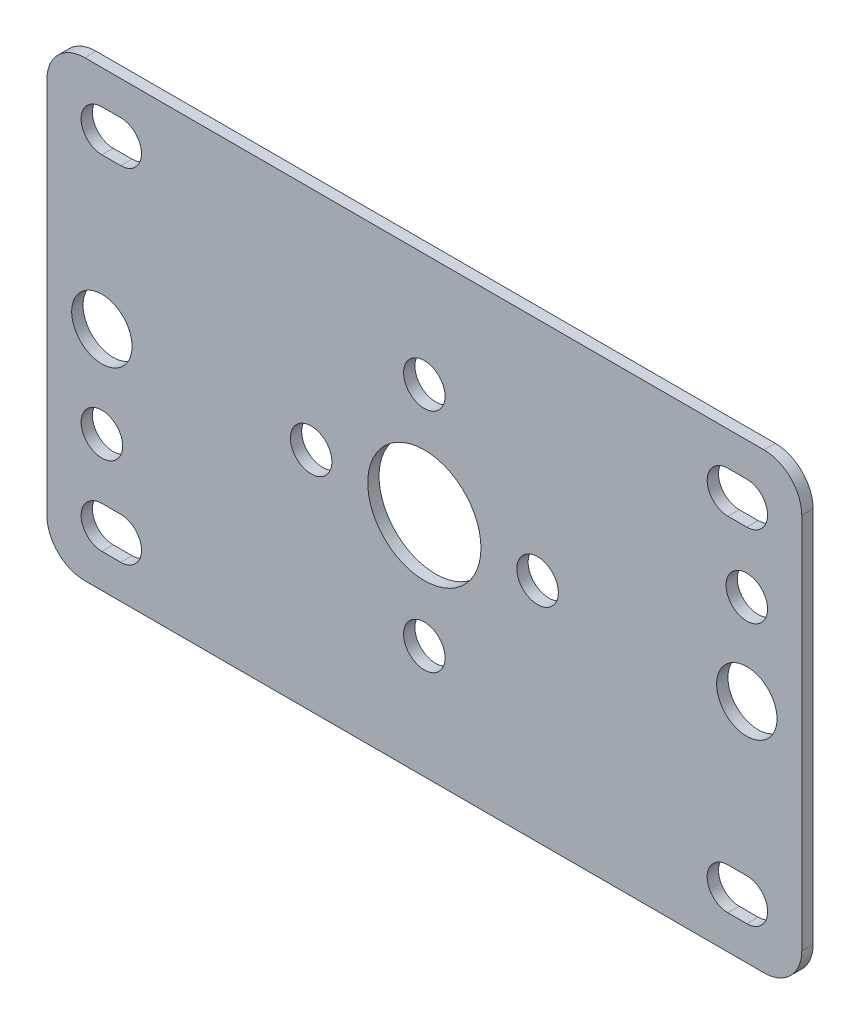
ISO-10303-21;
HEADER;
FILE_DESCRIPTION(('STEP AP214'),'2;1');
FILE_NAME('part.step','',(''),(''),'','','');
FILE_SCHEMA(('AUTOMOTIVE_DESIGN { 1 0 10303 214 1 1 1 1 }'));
ENDSEC;
DATA;
#1=APPLICATION_CONTEXT('core data for automotive mechanical design processes');
#2=APPLICATION_PROTOCOL_DEFINITION('international standard','automotive_design',2000,#1);
#3=PRODUCT_CONTEXT('',#1,'mechanical');
#4=PRODUCT('Part','Part','',(#3));
#5=PRODUCT_RELATED_PRODUCT_CATEGORY('part','',(#4));
#6=PRODUCT_DEFINITION_FORMATION('','',#4);
#7=PRODUCT_DEFINITION_CONTEXT('part definition',#1,'design');
#8=PRODUCT_DEFINITION('design','',#6,#7);
#9=PRODUCT_DEFINITION_SHAPE('','',#8);
#10=(LENGTH_UNIT() NAMED_UNIT(*) SI_UNIT(.MILLI.,.METRE.));
#11=(NAMED_UNIT(*) PLANE_ANGLE_UNIT() SI_UNIT($,.RADIAN.));
#12=(NAMED_UNIT(*) SI_UNIT($,.STERADIAN.) SOLID_ANGLE_UNIT());
#13=UNCERTAINTY_MEASURE_WITH_UNIT(LENGTH_MEASURE(1.E-05),#10,'distance_accuracy_value','');
#14=(GEOMETRIC_REPRESENTATION_CONTEXT(3) GLOBAL_UNCERTAINTY_ASSIGNED_CONTEXT((#13)) GLOBAL_UNIT_ASSIGNED_CONTEXT((#10,
#11,#12)) REPRESENTATION_CONTEXT('',''));
#15=CARTESIAN_POINT('',(0.,0.,0.));
#16=DIRECTION('',(0.,0.,1.));
#17=DIRECTION('',(1.,0.,0.));
#18=AXIS2_PLACEMENT_3D('',#15,#16,#17);
#19=CARTESIAN_POINT('',(0.,0.,-1.5));
#20=DIRECTION('',(0.,0.,1.));
#21=DIRECTION('',(1.,0.,0.));
#22=AXIS2_PLACEMENT_3D('',#19,#20,#21);
#23=PLANE('',#22);
#24=DIRECTION('',(1.,0.,0.));
#25=VECTOR('',#24,1.);
#26=CARTESIAN_POINT('',(40.22,-20.,-1.5));
#27=LINE('',#26,#25);
#28=CARTESIAN_POINT('',(40.22,-20.,-1.5));
#29=VERTEX_POINT('',#28);
#30=CARTESIAN_POINT('',(42.72,-20.,-1.5));
#31=VERTEX_POINT('',#30);
#32=EDGE_CURVE('E291',#29,#31,#27,.T.);
#33=ORIENTED_EDGE('',*,*,#32,.F.);
#34=CARTESIAN_POINT('',(40.22,-22.75,-1.5));
#35=DIRECTION('',(0.,0.,1.));
#36=DIRECTION('',(1.,0.,0.));
#37=AXIS2_PLACEMENT_3D('',#34,#35,#36);
#38=CIRCLE('',#37,2.75);
#39=CARTESIAN_POINT('',(40.22,-25.5,-1.5));
#40=VERTEX_POINT('',#39);
#41=EDGE_CURVE('E292',#29,#40,#38,.T.);
#42=ORIENTED_EDGE('',*,*,#41,.T.);
#43=DIRECTION('',(1.,0.,0.));
#44=VECTOR('',#43,1.);
#45=CARTESIAN_POINT('',(42.72,-25.5,-1.5));
#46=LINE('',#45,#44);
#47=CARTESIAN_POINT('',(42.72,-25.5,-1.5));
#48=VERTEX_POINT('',#47);
#49=EDGE_CURVE('E356',#48,#40,#46,.F.);
#50=ORIENTED_EDGE('',*,*,#49,.F.);
#51=CARTESIAN_POINT('',(42.72,-22.75,-1.5));
#52=DIRECTION('',(0.,0.,1.));
#53=DIRECTION('',(1.,0.,0.));
#54=AXIS2_PLACEMENT_3D('',#51,#52,#53);
#55=CIRCLE('',#54,2.75);
#56=EDGE_CURVE('E288',#48,#31,#55,.T.);
#57=ORIENTED_EDGE('',*,*,#56,.T.);
#58=EDGE_LOOP('',(#33,#42,#50,#57));
#59=FACE_BOUND('',#58,.T.);
#60=CARTESIAN_POINT('',(-40.22,-22.75,-1.5));
#61=DIRECTION('',(0.,0.,1.));
#62=DIRECTION('',(1.,0.,0.));
#63=AXIS2_PLACEMENT_3D('',#60,#61,#62);
#64=CIRCLE('',#63,2.75);
#65=CARTESIAN_POINT('',(-40.22,-25.5,-1.5));
#66=VERTEX_POINT('',#65);
#67=CARTESIAN_POINT('',(-40.22,-20.,-1.5));
#68=VERTEX_POINT('',#67);
#69=EDGE_CURVE('E299',#66,#68,#64,.T.);
#70=ORIENTED_EDGE('',*,*,#69,.T.);
#71=DIRECTION('',(1.,0.,0.));
#72=VECTOR('',#71,1.);
#73=CARTESIAN_POINT('',(-42.72,-20.,-1.5));
#74=LINE('',#73,#72);
#75=CARTESIAN_POINT('',(-42.72,-20.,-1.5));
#76=VERTEX_POINT('',#75);
#77=EDGE_CURVE('E302',#76,#68,#74,.T.);
#78=ORIENTED_EDGE('',*,*,#77,.F.);
#79=CARTESIAN_POINT('',(-42.72,-22.75,-1.5));
#80=DIRECTION('',(0.,0.,1.));
#81=DIRECTION('',(1.,0.,0.));
#82=AXIS2_PLACEMENT_3D('',#79,#80,#81);
#83=CIRCLE('',#82,2.75);
#84=CARTESIAN_POINT('',(-42.72,-25.5,-1.5));
#85=VERTEX_POINT('',#84);
#86=EDGE_CURVE('E296',#76,#85,#83,.T.);
#87=ORIENTED_EDGE('',*,*,#86,.T.);
#88=DIRECTION('',(1.,0.,0.));
#89=VECTOR('',#88,1.);
#90=CARTESIAN_POINT('',(-40.22,-25.5,-1.5));
#91=LINE('',#90,#89);
#92=EDGE_CURVE('E361',#66,#85,#91,.F.);
#93=ORIENTED_EDGE('',*,*,#92,.F.);
#94=EDGE_LOOP('',(#70,#78,#87,#93));
#95=FACE_BOUND('',#94,.T.);
#96=DIRECTION('',(1.,0.,0.));
#97=VECTOR('',#96,1.);
#98=CARTESIAN_POINT('',(-40.22,20.,-1.5));
#99=LINE('',#98,#97);
#100=CARTESIAN_POINT('',(-40.22,20.,-1.5));
#101=VERTEX_POINT('',#100);
#102=CARTESIAN_POINT('',(-42.72,20.,-1.5));
#103=VERTEX_POINT('',#102);
#104=EDGE_CURVE('E306',#101,#103,#99,.F.);
#105=ORIENTED_EDGE('',*,*,#104,.F.);
#106=CARTESIAN_POINT('',(-40.22,22.75,-1.5));
#107=DIRECTION('',(0.,0.,1.));
#108=DIRECTION('',(1.,0.,0.));
#109=AXIS2_PLACEMENT_3D('',#106,#107,#108);
#110=CIRCLE('',#109,2.75);
#111=CARTESIAN_POINT('',(-40.22,25.5,-1.5));
#112=VERTEX_POINT('',#111);
#113=EDGE_CURVE('E307',#101,#112,#110,.T.);
#114=ORIENTED_EDGE('',*,*,#113,.T.);
#115=DIRECTION('',(1.,0.,0.));
#116=VECTOR('',#115,1.);
#117=CARTESIAN_POINT('',(-42.72,25.5,-1.5));
#118=LINE('',#117,#116);
#119=CARTESIAN_POINT('',(-42.72,25.5,-1.5));
#120=VERTEX_POINT('',#119);
#121=EDGE_CURVE('E368',#120,#112,#118,.T.);
#122=ORIENTED_EDGE('',*,*,#121,.F.);
#123=CARTESIAN_POINT('',(-42.72,22.75,-1.5));
#124=DIRECTION('',(0.,0.,1.));
#125=DIRECTION('',(1.,0.,0.));
#126=AXIS2_PLACEMENT_3D('',#123,#124,#125);
#127=CIRCLE('',#126,2.75);
#128=EDGE_CURVE('E303',#120,#103,#127,.T.);
#129=ORIENTED_EDGE('',*,*,#128,.T.);
#130=EDGE_LOOP('',(#105,#114,#122,#129));
#131=FACE_BOUND('',#130,.T.);
#132=CARTESIAN_POINT('',(40.22,22.75,-1.5));
#133=DIRECTION('',(0.,0.,1.));
#134=DIRECTION('',(1.,0.,0.));
#135=AXIS2_PLACEMENT_3D('',#132,#133,#134);
#136=CIRCLE('',#135,2.75);
#137=CARTESIAN_POINT('',(40.22,25.5,-1.5));
#138=VERTEX_POINT('',#137);
#139=CARTESIAN_POINT('',(40.22,20.,-1.5));
#140=VERTEX_POINT('',#139);
#141=EDGE_CURVE('E314',#138,#140,#136,.T.);
#142=ORIENTED_EDGE('',*,*,#141,.T.);
#143=DIRECTION('',(1.,0.,0.));
#144=VECTOR('',#143,1.);
#145=CARTESIAN_POINT('',(42.72,20.,-1.5));
#146=LINE('',#145,#144);
#147=CARTESIAN_POINT('',(42.72,20.,-1.5));
#148=VERTEX_POINT('',#147);
#149=EDGE_CURVE('E204',#148,#140,#146,.F.);
#150=ORIENTED_EDGE('',*,*,#149,.F.);
#151=CARTESIAN_POINT('',(42.72,22.75,-1.5));
#152=DIRECTION('',(0.,0.,1.));
#153=DIRECTION('',(1.,0.,0.));
#154=AXIS2_PLACEMENT_3D('',#151,#152,#153);
#155=CIRCLE('',#154,2.75);
#156=CARTESIAN_POINT('',(42.72,25.5,-1.5));
#157=VERTEX_POINT('',#156);
#158=EDGE_CURVE('E311',#148,#157,#155,.T.);
#159=ORIENTED_EDGE('',*,*,#158,.T.);
#160=DIRECTION('',(1.,0.,0.));
#161=VECTOR('',#160,1.);
#162=CARTESIAN_POINT('',(40.22,25.5,-1.5));
#163=LINE('',#162,#161);
#164=EDGE_CURVE('E373',#138,#157,#163,.T.);
#165=ORIENTED_EDGE('',*,*,#164,.F.);
#166=EDGE_LOOP('',(#142,#150,#159,#165));
#167=FACE_BOUND('',#166,.T.);
#168=CARTESIAN_POINT('',(42.72,0.,-1.5));
#169=DIRECTION('',(0.,0.,1.));
#170=DIRECTION('',(1.,0.,0.));
#171=AXIS2_PLACEMENT_3D('',#168,#169,#170);
#172=CIRCLE('',#171,4.);
#173=CARTESIAN_POINT('',(46.72,0.,-1.5));
#174=VERTEX_POINT('',#173);
#175=EDGE_CURVE('E317',#174,#174,#172,.T.);
#176=ORIENTED_EDGE('',*,*,#175,.T.);
#177=EDGE_LOOP('',(#176));
#178=FACE_BOUND('',#177,.T.);
#179=CARTESIAN_POINT('',(0.,0.,-1.5));
#180=DIRECTION('',(0.,0.,1.));
#181=DIRECTION('',(1.,0.,0.));
#182=AXIS2_PLACEMENT_3D('',#179,#180,#181);
#183=CIRCLE('',#182,7.5);
#184=CARTESIAN_POINT('',(7.5,0.,-1.5));
#185=VERTEX_POINT('',#184);
#186=EDGE_CURVE('E320',#185,#185,#183,.T.);
#187=ORIENTED_EDGE('',*,*,#186,.T.);
#188=EDGE_LOOP('',(#187));
#189=FACE_BOUND('',#188,.T.);
#190=CARTESIAN_POINT('',(0.,-15.,-1.5));
#191=DIRECTION('',(0.,0.,1.));
#192=DIRECTION('',(1.,0.,0.));
#193=AXIS2_PLACEMENT_3D('',#190,#191,#192);
#194=CIRCLE('',#193,2.75);
#195=CARTESIAN_POINT('',(2.75,-15.,-1.5));
#196=VERTEX_POINT('',#195);
#197=EDGE_CURVE('E323',#196,#196,#194,.T.);
#198=ORIENTED_EDGE('',*,*,#197,.T.);
#199=EDGE_LOOP('',(#198));
#200=FACE_BOUND('',#199,.T.);
#201=CARTESIAN_POINT('',(-15.,0.,-1.5));
#202=DIRECTION('',(0.,0.,1.));
#203=DIRECTION('',(1.,0.,0.));
#204=AXIS2_PLACEMENT_3D('',#201,#202,#203);
#205=CIRCLE('',#204,2.75);
#206=CARTESIAN_POINT('',(-12.25,0.,-1.5));
#207=VERTEX_POINT('',#206);
#208=EDGE_CURVE('E326',#207,#207,#205,.T.);
#209=ORIENTED_EDGE('',*,*,#208,.T.);
#210=EDGE_LOOP('',(#209));
#211=FACE_BOUND('',#210,.T.);
#212=CARTESIAN_POINT('',(0.,15.,-1.5));
#213=DIRECTION('',(0.,0.,1.));
#214=DIRECTION('',(1.,0.,0.));
#215=AXIS2_PLACEMENT_3D('',#212,#213,#214);
#216=CIRCLE('',#215,2.75);
#217=CARTESIAN_POINT('',(2.75000000000001,15.,-1.5));
#218=VERTEX_POINT('',#217);
#219=EDGE_CURVE('E329',#218,#218,#216,.T.);
#220=ORIENTED_EDGE('',*,*,#219,.T.);
#221=EDGE_LOOP('',(#220));
#222=FACE_BOUND('',#221,.T.);
#223=CARTESIAN_POINT('',(15.,0.,-1.5));
#224=DIRECTION('',(0.,0.,1.));
#225=DIRECTION('',(1.,0.,0.));
#226=AXIS2_PLACEMENT_3D('',#223,#224,#225);
#227=CIRCLE('',#226,2.75);
#228=CARTESIAN_POINT('',(17.75,0.,-1.5));
#229=VERTEX_POINT('',#228);
#230=EDGE_CURVE('E332',#229,#229,#227,.T.);
#231=ORIENTED_EDGE('',*,*,#230,.T.);
#232=EDGE_LOOP('',(#231));
#233=FACE_BOUND('',#232,.T.);
#234=CARTESIAN_POINT('',(-42.72,-12.05,-1.5));
#235=DIRECTION('',(0.,0.,1.));
#236=DIRECTION('',(1.,0.,0.));
#237=AXIS2_PLACEMENT_3D('',#234,#235,#236);
#238=CIRCLE('',#237,2.75);
#239=CARTESIAN_POINT('',(-39.97,-12.05,-1.5));
#240=VERTEX_POINT('',#239);
#241=EDGE_CURVE('E335',#240,#240,#238,.T.);
#242=ORIENTED_EDGE('',*,*,#241,.T.);
#243=EDGE_LOOP('',(#242));
#244=FACE_BOUND('',#243,.T.);
#245=CARTESIAN_POINT('',(42.72,11.97,-1.5));
#246=DIRECTION('',(0.,0.,1.));
#247=DIRECTION('',(1.,0.,0.));
#248=AXIS2_PLACEMENT_3D('',#245,#246,#247);
#249=CIRCLE('',#248,2.75);
#250=CARTESIAN_POINT('',(45.47,11.97,-1.5));
#251=VERTEX_POINT('',#250);
#252=EDGE_CURVE('E338',#251,#251,#249,.T.);
#253=ORIENTED_EDGE('',*,*,#252,.T.);
#254=EDGE_LOOP('',(#253));
#255=FACE_BOUND('',#254,.T.);
#256=CARTESIAN_POINT('',(-42.72,0.,-1.5));
#257=DIRECTION('',(0.,0.,1.));
#258=DIRECTION('',(1.,0.,0.));
#259=AXIS2_PLACEMENT_3D('',#256,#257,#258);
#260=CIRCLE('',#259,4.);
#261=CARTESIAN_POINT('',(-38.72,0.,-1.5));
#262=VERTEX_POINT('',#261);
#263=EDGE_CURVE('E195',#262,#262,#260,.T.);
#264=ORIENTED_EDGE('',*,*,#263,.T.);
#265=EDGE_LOOP('',(#264));
#266=FACE_BOUND('',#265,.T.);
#267=DIRECTION('',(0.,1.,0.));
#268=VECTOR('',#267,1.);
#269=CARTESIAN_POINT('',(50.,-25.,-1.5));
#270=LINE('',#269,#268);
#271=CARTESIAN_POINT('',(50.,-25.,-1.5));
#272=VERTEX_POINT('',#271);
#273=CARTESIAN_POINT('',(50.,25.,-1.5));
#274=VERTEX_POINT('',#273);
#275=EDGE_CURVE('E206',#272,#274,#270,.T.);
#276=ORIENTED_EDGE('',*,*,#275,.F.);
#277=CARTESIAN_POINT('',(45.,-25.,-1.5));
#278=DIRECTION('',(0.,0.,1.));
#279=DIRECTION('',(1.,0.,0.));
#280=AXIS2_PLACEMENT_3D('',#277,#278,#279);
#281=CIRCLE('',#280,5.);
#282=CARTESIAN_POINT('',(45.,-30.,-1.5));
#283=VERTEX_POINT('',#282);
#284=EDGE_CURVE('E344',#283,#272,#281,.T.);
#285=ORIENTED_EDGE('',*,*,#284,.F.);
#286=DIRECTION('',(1.,0.,0.));
#287=VECTOR('',#286,1.);
#288=CARTESIAN_POINT('',(-45.,-30.,-1.5));
#289=LINE('',#288,#287);
#290=CARTESIAN_POINT('',(-45.,-30.,-1.5));
#291=VERTEX_POINT('',#290);
#292=EDGE_CURVE('E210',#291,#283,#289,.T.);
#293=ORIENTED_EDGE('',*,*,#292,.F.);
#294=CARTESIAN_POINT('',(-45.,-25.,-1.5));
#295=DIRECTION('',(0.,0.,1.));
#296=DIRECTION('',(1.,0.,0.));
#297=AXIS2_PLACEMENT_3D('',#294,#295,#296);
#298=CIRCLE('',#297,5.);
#299=CARTESIAN_POINT('',(-50.,-25.,-1.5));
#300=VERTEX_POINT('',#299);
#301=EDGE_CURVE('E345',#300,#291,#298,.T.);
#302=ORIENTED_EDGE('',*,*,#301,.F.);
#303=DIRECTION('',(0.,1.,0.));
#304=VECTOR('',#303,1.);
#305=CARTESIAN_POINT('',(-50.,25.,-1.5));
#306=LINE('',#305,#304);
#307=CARTESIAN_POINT('',(-50.,25.,-1.5));
#308=VERTEX_POINT('',#307);
#309=EDGE_CURVE('E183',#308,#300,#306,.F.);
#310=ORIENTED_EDGE('',*,*,#309,.F.);
#311=CARTESIAN_POINT('',(-45.,25.,-1.5));
#312=DIRECTION('',(0.,0.,1.));
#313=DIRECTION('',(1.,0.,0.));
#314=AXIS2_PLACEMENT_3D('',#311,#312,#313);
#315=CIRCLE('',#314,5.);
#316=CARTESIAN_POINT('',(-45.,30.,-1.5));
#317=VERTEX_POINT('',#316);
#318=EDGE_CURVE('E20',#317,#308,#315,.T.);
#319=ORIENTED_EDGE('',*,*,#318,.F.);
#320=DIRECTION('',(1.,0.,0.));
#321=VECTOR('',#320,1.);
#322=CARTESIAN_POINT('',(45.,30.,-1.5));
#323=LINE('',#322,#321);
#324=CARTESIAN_POINT('',(45.,30.,-1.5));
#325=VERTEX_POINT('',#324);
#326=EDGE_CURVE('E180',#325,#317,#323,.F.);
#327=ORIENTED_EDGE('',*,*,#326,.F.);
#328=CARTESIAN_POINT('',(45.,25.,-1.5));
#329=DIRECTION('',(0.,0.,1.));
#330=DIRECTION('',(1.,0.,0.));
#331=AXIS2_PLACEMENT_3D('',#328,#329,#330);
#332=CIRCLE('',#331,5.);
#333=EDGE_CURVE('E200',#274,#325,#332,.T.);
#334=ORIENTED_EDGE('',*,*,#333,.F.);
#335=EDGE_LOOP('',(#276,#285,#293,#302,#310,#319,#327,#334));
#336=FACE_BOUND('',#335,.T.);
#337=ADVANCED_FACE('F17',(#59,#95,#131,#167,#178,#189,#200,#211,#222,#233,#244,#255,#266,#336),
#23,.F.);
#338=CARTESIAN_POINT('',(-45.,25.,0.));
#339=DIRECTION('',(0.,0.,1.));
#340=DIRECTION('',(1.,0.,0.));
#341=AXIS2_PLACEMENT_3D('',#338,#339,#340);
#342=CYLINDRICAL_SURFACE('',#341,5.);
#343=DIRECTION('',(0.,0.,1.));
#344=VECTOR('',#343,1.);
#345=CARTESIAN_POINT('',(-50.,25.,0.));
#346=LINE('',#345,#344);
#347=CARTESIAN_POINT('',(-50.,25.,0.));
#348=VERTEX_POINT('',#347);
#349=EDGE_CURVE('E186',#348,#308,#346,.F.);
#350=ORIENTED_EDGE('',*,*,#349,.F.);
#351=CARTESIAN_POINT('',(-45.,25.,0.));
#352=DIRECTION('',(0.,0.,1.));
#353=DIRECTION('',(1.,0.,0.));
#354=AXIS2_PLACEMENT_3D('',#351,#352,#353);
#355=CIRCLE('',#354,5.);
#356=CARTESIAN_POINT('',(-45.,30.,0.));
#357=VERTEX_POINT('',#356);
#358=EDGE_CURVE('E191',#357,#348,#355,.T.);
#359=ORIENTED_EDGE('',*,*,#358,.F.);
#360=DIRECTION('',(0.,0.,1.));
#361=VECTOR('',#360,1.);
#362=CARTESIAN_POINT('',(-45.,30.,0.));
#363=LINE('',#362,#361);
#364=EDGE_CURVE('E188',#317,#357,#363,.T.);
#365=ORIENTED_EDGE('',*,*,#364,.F.);
#366=ORIENTED_EDGE('',*,*,#318,.T.);
#367=EDGE_LOOP('',(#350,#359,#365,#366));
#368=FACE_BOUND('',#367,.T.);
#369=ADVANCED_FACE('F189',(#368),#342,.T.);
#370=CARTESIAN_POINT('',(-50.,25.,0.));
#371=DIRECTION('',(-1.,0.,0.));
#372=DIRECTION('',(0.,0.,1.));
#373=AXIS2_PLACEMENT_3D('',#370,#371,#372);
#374=PLANE('',#373);
#375=DIRECTION('',(0.,0.,1.));
#376=VECTOR('',#375,1.);
#377=CARTESIAN_POINT('',(-50.,-25.,0.));
#378=LINE('',#377,#376);
#379=CARTESIAN_POINT('',(-50.,-25.,0.));
#380=VERTEX_POINT('',#379);
#381=EDGE_CURVE('E215',#380,#300,#378,.F.);
#382=ORIENTED_EDGE('',*,*,#381,.F.);
#383=DIRECTION('',(0.,1.,0.));
#384=VECTOR('',#383,1.);
#385=CARTESIAN_POINT('',(-50.,0.,0.));
#386=LINE('',#385,#384);
#387=EDGE_CURVE('E285',#348,#380,#386,.F.);
#388=ORIENTED_EDGE('',*,*,#387,.F.);
#389=ORIENTED_EDGE('',*,*,#349,.T.);
#390=ORIENTED_EDGE('',*,*,#309,.T.);
#391=EDGE_LOOP('',(#382,#388,#389,#390));
#392=FACE_BOUND('',#391,.T.);
#393=ADVANCED_FACE('F569',(#392),#374,.T.);
#394=CARTESIAN_POINT('',(-45.,-25.,0.));
#395=DIRECTION('',(0.,0.,1.));
#396=DIRECTION('',(1.,0.,0.));
#397=AXIS2_PLACEMENT_3D('',#394,#395,#396);
#398=CYLINDRICAL_SURFACE('',#397,5.);
#399=DIRECTION('',(0.,0.,-1.));
#400=VECTOR('',#399,1.);
#401=CARTESIAN_POINT('',(-45.,-30.,0.));
#402=LINE('',#401,#400);
#403=CARTESIAN_POINT('',(-45.,-30.,0.));
#404=VERTEX_POINT('',#403);
#405=EDGE_CURVE('E213',#404,#291,#402,.T.);
#406=ORIENTED_EDGE('',*,*,#405,.F.);
#407=CARTESIAN_POINT('',(-45.,-25.,0.));
#408=DIRECTION('',(0.,0.,1.));
#409=DIRECTION('',(1.,0.,0.));
#410=AXIS2_PLACEMENT_3D('',#407,#408,#409);
#411=CIRCLE('',#410,5.);
#412=EDGE_CURVE('E282',#380,#404,#411,.T.);
#413=ORIENTED_EDGE('',*,*,#412,.F.);
#414=ORIENTED_EDGE('',*,*,#381,.T.);
#415=ORIENTED_EDGE('',*,*,#301,.T.);
#416=EDGE_LOOP('',(#406,#413,#414,#415));
#417=FACE_BOUND('',#416,.T.);
#418=ADVANCED_FACE('F646',(#417),#398,.T.);
#419=CARTESIAN_POINT('',(-45.,-30.,0.));
#420=DIRECTION('',(0.,-1.,0.));
#421=DIRECTION('',(0.,0.,-1.));
#422=AXIS2_PLACEMENT_3D('',#419,#420,#421);
#423=PLANE('',#422);
#424=DIRECTION('',(0.,0.,1.));
#425=VECTOR('',#424,1.);
#426=CARTESIAN_POINT('',(45.,-30.,0.));
#427=LINE('',#426,#425);
#428=CARTESIAN_POINT('',(45.,-30.,0.));
#429=VERTEX_POINT('',#428);
#430=EDGE_CURVE('E212',#429,#283,#427,.F.);
#431=ORIENTED_EDGE('',*,*,#430,.F.);
#432=DIRECTION('',(1.,0.,0.));
#433=VECTOR('',#432,1.);
#434=CARTESIAN_POINT('',(0.,-30.,0.));
#435=LINE('',#434,#433);
#436=EDGE_CURVE('E281',#404,#429,#435,.T.);
#437=ORIENTED_EDGE('',*,*,#436,.F.);
#438=ORIENTED_EDGE('',*,*,#405,.T.);
#439=ORIENTED_EDGE('',*,*,#292,.T.);
#440=EDGE_LOOP('',(#431,#437,#438,#439));
#441=FACE_BOUND('',#440,.T.);
#442=ADVANCED_FACE('F398',(#441),#423,.T.);
#443=CARTESIAN_POINT('',(45.,-25.,0.));
#444=DIRECTION('',(0.,0.,1.));
#445=DIRECTION('',(1.,0.,0.));
#446=AXIS2_PLACEMENT_3D('',#443,#444,#445);
#447=CYLINDRICAL_SURFACE('',#446,5.);
#448=DIRECTION('',(0.,0.,-1.));
#449=VECTOR('',#448,1.);
#450=CARTESIAN_POINT('',(50.,-25.,0.));
#451=LINE('',#450,#449);
#452=CARTESIAN_POINT('',(50.,-25.,0.));
#453=VERTEX_POINT('',#452);
#454=EDGE_CURVE('E209',#453,#272,#451,.T.);
#455=ORIENTED_EDGE('',*,*,#454,.F.);
#456=CARTESIAN_POINT('',(45.,-25.,0.));
#457=DIRECTION('',(0.,0.,1.));
#458=DIRECTION('',(1.,0.,0.));
#459=AXIS2_PLACEMENT_3D('',#456,#457,#458);
#460=CIRCLE('',#459,5.);
#461=EDGE_CURVE('E278',#429,#453,#460,.T.);
#462=ORIENTED_EDGE('',*,*,#461,.F.);
#463=ORIENTED_EDGE('',*,*,#430,.T.);
#464=ORIENTED_EDGE('',*,*,#284,.T.);
#465=EDGE_LOOP('',(#455,#462,#463,#464));
#466=FACE_BOUND('',#465,.T.);
#467=ADVANCED_FACE('F393',(#466),#447,.T.);
#468=CARTESIAN_POINT('',(50.,-25.,0.));
#469=DIRECTION('',(1.,0.,0.));
#470=DIRECTION('',(0.,0.,-1.));
#471=AXIS2_PLACEMENT_3D('',#468,#469,#470);
#472=PLANE('',#471);
#473=DIRECTION('',(0.,0.,1.));
#474=VECTOR('',#473,1.);
#475=CARTESIAN_POINT('',(50.,25.,0.));
#476=LINE('',#475,#474);
#477=CARTESIAN_POINT('',(50.,25.,0.));
#478=VERTEX_POINT('',#477);
#479=EDGE_CURVE('E208',#478,#274,#476,.F.);
#480=ORIENTED_EDGE('',*,*,#479,.F.);
#481=DIRECTION('',(0.,1.,0.));
#482=VECTOR('',#481,1.);
#483=CARTESIAN_POINT('',(50.,0.,0.));
#484=LINE('',#483,#482);
#485=EDGE_CURVE('E277',#453,#478,#484,.T.);
#486=ORIENTED_EDGE('',*,*,#485,.F.);
#487=ORIENTED_EDGE('',*,*,#454,.T.);
#488=ORIENTED_EDGE('',*,*,#275,.T.);
#489=EDGE_LOOP('',(#480,#486,#487,#488));
#490=FACE_BOUND('',#489,.T.);
#491=ADVANCED_FACE('F401',(#490),#472,.T.);
#492=CARTESIAN_POINT('',(45.,25.,0.));
#493=DIRECTION('',(0.,0.,1.));
#494=DIRECTION('',(1.,0.,0.));
#495=AXIS2_PLACEMENT_3D('',#492,#493,#494);
#496=CYLINDRICAL_SURFACE('',#495,5.);
#497=DIRECTION('',(0.,0.,1.));
#498=VECTOR('',#497,1.);
#499=CARTESIAN_POINT('',(45.,30.,0.));
#500=LINE('',#499,#498);
#501=CARTESIAN_POINT('',(45.,30.,0.));
#502=VERTEX_POINT('',#501);
#503=EDGE_CURVE('E198',#502,#325,#500,.F.);
#504=ORIENTED_EDGE('',*,*,#503,.F.);
#505=CARTESIAN_POINT('',(45.,25.,0.));
#506=DIRECTION('',(0.,0.,1.));
#507=DIRECTION('',(1.,0.,0.));
#508=AXIS2_PLACEMENT_3D('',#505,#506,#507);
#509=CIRCLE('',#508,5.);
#510=EDGE_CURVE('E274',#478,#502,#509,.T.);
#511=ORIENTED_EDGE('',*,*,#510,.F.);
#512=ORIENTED_EDGE('',*,*,#479,.T.);
#513=ORIENTED_EDGE('',*,*,#333,.T.);
#514=EDGE_LOOP('',(#504,#511,#512,#513));
#515=FACE_BOUND('',#514,.T.);
#516=ADVANCED_FACE('F446',(#515),#496,.T.);
#517=CARTESIAN_POINT('',(45.,30.,0.));
#518=DIRECTION('',(0.,1.,0.));
#519=DIRECTION('',(0.,0.,1.));
#520=AXIS2_PLACEMENT_3D('',#517,#518,#519);
#521=PLANE('',#520);
#522=ORIENTED_EDGE('',*,*,#364,.T.);
#523=DIRECTION('',(1.,0.,0.));
#524=VECTOR('',#523,1.);
#525=CARTESIAN_POINT('',(0.,30.,0.));
#526=LINE('',#525,#524);
#527=EDGE_CURVE('E273',#502,#357,#526,.F.);
#528=ORIENTED_EDGE('',*,*,#527,.F.);
#529=ORIENTED_EDGE('',*,*,#503,.T.);
#530=ORIENTED_EDGE('',*,*,#326,.T.);
#531=EDGE_LOOP('',(#522,#528,#529,#530));
#532=FACE_BOUND('',#531,.T.);
#533=ADVANCED_FACE('F197',(#532),#521,.T.);
#534=CARTESIAN_POINT('',(-42.72,0.,0.));
#535=DIRECTION('',(0.,0.,1.));
#536=DIRECTION('',(1.,0.,0.));
#537=AXIS2_PLACEMENT_3D('',#534,#535,#536);
#538=CYLINDRICAL_SURFACE('',#537,4.);
#539=ORIENTED_EDGE('',*,*,#263,.F.);
#540=EDGE_LOOP('',(#539));
#541=FACE_BOUND('',#540,.T.);
#542=CARTESIAN_POINT('',(-42.72,0.,0.));
#543=DIRECTION('',(0.,0.,1.));
#544=DIRECTION('',(1.,0.,0.));
#545=AXIS2_PLACEMENT_3D('',#542,#543,#544);
#546=CIRCLE('',#545,4.);
#547=CARTESIAN_POINT('',(-38.72,0.,0.));
#548=VERTEX_POINT('',#547);
#549=EDGE_CURVE('E270',#548,#548,#546,.F.);
#550=ORIENTED_EDGE('',*,*,#549,.F.);
#551=EDGE_LOOP('',(#550));
#552=FACE_BOUND('',#551,.T.);
#553=ADVANCED_FACE('F454',(#541,#552),#538,.F.);
#554=CARTESIAN_POINT('',(42.72,11.97,0.));
#555=DIRECTION('',(0.,0.,1.));
#556=DIRECTION('',(1.,0.,0.));
#557=AXIS2_PLACEMENT_3D('',#554,#555,#556);
#558=CYLINDRICAL_SURFACE('',#557,2.75);
#559=ORIENTED_EDGE('',*,*,#252,.F.);
#560=EDGE_LOOP('',(#559));
#561=FACE_BOUND('',#560,.T.);
#562=CARTESIAN_POINT('',(42.72,11.97,0.));
#563=DIRECTION('',(0.,0.,1.));
#564=DIRECTION('',(1.,0.,0.));
#565=AXIS2_PLACEMENT_3D('',#562,#563,#564);
#566=CIRCLE('',#565,2.75);
#567=CARTESIAN_POINT('',(45.47,11.97,0.));
#568=VERTEX_POINT('',#567);
#569=EDGE_CURVE('E267',#568,#568,#566,.F.);
#570=ORIENTED_EDGE('',*,*,#569,.F.);
#571=EDGE_LOOP('',(#570));
#572=FACE_BOUND('',#571,.T.);
#573=ADVANCED_FACE('F550',(#561,#572),#558,.F.);
#574=CARTESIAN_POINT('',(-42.72,-12.05,0.));
#575=DIRECTION('',(0.,0.,1.));
#576=DIRECTION('',(1.,0.,0.));
#577=AXIS2_PLACEMENT_3D('',#574,#575,#576);
#578=CYLINDRICAL_SURFACE('',#577,2.75);
#579=ORIENTED_EDGE('',*,*,#241,.F.);
#580=EDGE_LOOP('',(#579));
#581=FACE_BOUND('',#580,.T.);
#582=CARTESIAN_POINT('',(-42.72,-12.05,0.));
#583=DIRECTION('',(0.,0.,1.));
#584=DIRECTION('',(1.,0.,0.));
#585=AXIS2_PLACEMENT_3D('',#582,#583,#584);
#586=CIRCLE('',#585,2.75);
#587=CARTESIAN_POINT('',(-39.97,-12.05,0.));
#588=VERTEX_POINT('',#587);
#589=EDGE_CURVE('E264',#588,#588,#586,.F.);
#590=ORIENTED_EDGE('',*,*,#589,.F.);
#591=EDGE_LOOP('',(#590));
#592=FACE_BOUND('',#591,.T.);
#593=ADVANCED_FACE('F546',(#581,#592),#578,.F.);
#594=CARTESIAN_POINT('',(15.,0.,0.));
#595=DIRECTION('',(0.,0.,1.));
#596=DIRECTION('',(1.,0.,0.));
#597=AXIS2_PLACEMENT_3D('',#594,#595,#596);
#598=CYLINDRICAL_SURFACE('',#597,2.75);
#599=ORIENTED_EDGE('',*,*,#230,.F.);
#600=EDGE_LOOP('',(#599));
#601=FACE_BOUND('',#600,.T.);
#602=CARTESIAN_POINT('',(15.,0.,0.));
#603=DIRECTION('',(0.,0.,1.));
#604=DIRECTION('',(1.,0.,0.));
#605=AXIS2_PLACEMENT_3D('',#602,#603,#604);
#606=CIRCLE('',#605,2.75);
#607=CARTESIAN_POINT('',(17.75,0.,0.));
#608=VERTEX_POINT('',#607);
#609=EDGE_CURVE('E261',#608,#608,#606,.F.);
#610=ORIENTED_EDGE('',*,*,#609,.F.);
#611=EDGE_LOOP('',(#610));
#612=FACE_BOUND('',#611,.T.);
#613=ADVANCED_FACE('F542',(#601,#612),#598,.F.);
#614=CARTESIAN_POINT('',(0.,15.,0.));
#615=DIRECTION('',(0.,0.,1.));
#616=DIRECTION('',(1.,0.,0.));
#617=AXIS2_PLACEMENT_3D('',#614,#615,#616);
#618=CYLINDRICAL_SURFACE('',#617,2.75);
#619=ORIENTED_EDGE('',*,*,#219,.F.);
#620=EDGE_LOOP('',(#619));
#621=FACE_BOUND('',#620,.T.);
#622=CARTESIAN_POINT('',(0.,15.,0.));
#623=DIRECTION('',(0.,0.,1.));
#624=DIRECTION('',(1.,0.,0.));
#625=AXIS2_PLACEMENT_3D('',#622,#623,#624);
#626=CIRCLE('',#625,2.75);
#627=CARTESIAN_POINT('',(2.75000000000001,15.,0.));
#628=VERTEX_POINT('',#627);
#629=EDGE_CURVE('E258',#628,#628,#626,.F.);
#630=ORIENTED_EDGE('',*,*,#629,.F.);
#631=EDGE_LOOP('',(#630));
#632=FACE_BOUND('',#631,.T.);
#633=ADVANCED_FACE('F538',(#621,#632),#618,.F.);
#634=CARTESIAN_POINT('',(-15.,0.,0.));
#635=DIRECTION('',(0.,0.,1.));
#636=DIRECTION('',(1.,0.,0.));
#637=AXIS2_PLACEMENT_3D('',#634,#635,#636);
#638=CYLINDRICAL_SURFACE('',#637,2.75);
#639=ORIENTED_EDGE('',*,*,#208,.F.);
#640=EDGE_LOOP('',(#639));
#641=FACE_BOUND('',#640,.T.);
#642=CARTESIAN_POINT('',(-15.,0.,0.));
#643=DIRECTION('',(0.,0.,1.));
#644=DIRECTION('',(1.,0.,0.));
#645=AXIS2_PLACEMENT_3D('',#642,#643,#644);
#646=CIRCLE('',#645,2.75);
#647=CARTESIAN_POINT('',(-12.25,0.,0.));
#648=VERTEX_POINT('',#647);
#649=EDGE_CURVE('E255',#648,#648,#646,.F.);
#650=ORIENTED_EDGE('',*,*,#649,.F.);
#651=EDGE_LOOP('',(#650));
#652=FACE_BOUND('',#651,.T.);
#653=ADVANCED_FACE('F534',(#641,#652),#638,.F.);
#654=CARTESIAN_POINT('',(0.,-15.,0.));
#655=DIRECTION('',(0.,0.,1.));
#656=DIRECTION('',(1.,0.,0.));
#657=AXIS2_PLACEMENT_3D('',#654,#655,#656);
#658=CYLINDRICAL_SURFACE('',#657,2.75);
#659=ORIENTED_EDGE('',*,*,#197,.F.);
#660=EDGE_LOOP('',(#659));
#661=FACE_BOUND('',#660,.T.);
#662=CARTESIAN_POINT('',(0.,-15.,0.));
#663=DIRECTION('',(0.,0.,1.));
#664=DIRECTION('',(1.,0.,0.));
#665=AXIS2_PLACEMENT_3D('',#662,#663,#664);
#666=CIRCLE('',#665,2.75);
#667=CARTESIAN_POINT('',(2.75,-15.,0.));
#668=VERTEX_POINT('',#667);
#669=EDGE_CURVE('E252',#668,#668,#666,.F.);
#670=ORIENTED_EDGE('',*,*,#669,.F.);
#671=EDGE_LOOP('',(#670));
#672=FACE_BOUND('',#671,.T.);
#673=ADVANCED_FACE('F530',(#661,#672),#658,.F.);
#674=CARTESIAN_POINT('',(0.,0.,0.));
#675=DIRECTION('',(0.,0.,1.));
#676=DIRECTION('',(1.,0.,0.));
#677=AXIS2_PLACEMENT_3D('',#674,#675,#676);
#678=CYLINDRICAL_SURFACE('',#677,7.5);
#679=ORIENTED_EDGE('',*,*,#186,.F.);
#680=EDGE_LOOP('',(#679));
#681=FACE_BOUND('',#680,.T.);
#682=CARTESIAN_POINT('',(0.,0.,0.));
#683=DIRECTION('',(0.,0.,1.));
#684=DIRECTION('',(1.,0.,0.));
#685=AXIS2_PLACEMENT_3D('',#682,#683,#684);
#686=CIRCLE('',#685,7.5);
#687=CARTESIAN_POINT('',(7.5,0.,0.));
#688=VERTEX_POINT('',#687);
#689=EDGE_CURVE('E249',#688,#688,#686,.F.);
#690=ORIENTED_EDGE('',*,*,#689,.F.);
#691=EDGE_LOOP('',(#690));
#692=FACE_BOUND('',#691,.T.);
#693=ADVANCED_FACE('F526',(#681,#692),#678,.F.);
#694=CARTESIAN_POINT('',(42.72,0.,0.));
#695=DIRECTION('',(0.,0.,1.));
#696=DIRECTION('',(1.,0.,0.));
#697=AXIS2_PLACEMENT_3D('',#694,#695,#696);
#698=CYLINDRICAL_SURFACE('',#697,4.);
#699=ORIENTED_EDGE('',*,*,#175,.F.);
#700=EDGE_LOOP('',(#699));
#701=FACE_BOUND('',#700,.T.);
#702=CARTESIAN_POINT('',(42.72,0.,0.));
#703=DIRECTION('',(0.,0.,1.));
#704=DIRECTION('',(1.,0.,0.));
#705=AXIS2_PLACEMENT_3D('',#702,#703,#704);
#706=CIRCLE('',#705,4.);
#707=CARTESIAN_POINT('',(46.72,0.,0.));
#708=VERTEX_POINT('',#707);
#709=EDGE_CURVE('E246',#708,#708,#706,.F.);
#710=ORIENTED_EDGE('',*,*,#709,.F.);
#711=EDGE_LOOP('',(#710));
#712=FACE_BOUND('',#711,.T.);
#713=ADVANCED_FACE('F522',(#701,#712),#698,.F.);
#714=CARTESIAN_POINT('',(42.72,20.,0.));
#715=DIRECTION('',(0.,1.,0.));
#716=DIRECTION('',(0.,0.,1.));
#717=AXIS2_PLACEMENT_3D('',#714,#715,#716);
#718=PLANE('',#717);
#719=DIRECTION('',(0.,0.,1.));
#720=VECTOR('',#719,1.);
#721=CARTESIAN_POINT('',(40.22,20.,0.));
#722=LINE('',#721,#720);
#723=CARTESIAN_POINT('',(40.22,20.,0.));
#724=VERTEX_POINT('',#723);
#725=EDGE_CURVE('E316',#140,#724,#722,.T.);
#726=ORIENTED_EDGE('',*,*,#725,.T.);
#727=DIRECTION('',(1.,0.,0.));
#728=VECTOR('',#727,1.);
#729=CARTESIAN_POINT('',(0.,20.,0.));
#730=LINE('',#729,#728);
#731=CARTESIAN_POINT('',(42.72,20.,0.));
#732=VERTEX_POINT('',#731);
#733=EDGE_CURVE('E245',#732,#724,#730,.F.);
#734=ORIENTED_EDGE('',*,*,#733,.F.);
#735=DIRECTION('',(0.,0.,1.));
#736=VECTOR('',#735,1.);
#737=CARTESIAN_POINT('',(42.72,20.,0.));
#738=LINE('',#737,#736);
#739=EDGE_CURVE('E313',#732,#148,#738,.F.);
#740=ORIENTED_EDGE('',*,*,#739,.T.);
#741=ORIENTED_EDGE('',*,*,#149,.T.);
#742=EDGE_LOOP('',(#726,#734,#740,#741));
#743=FACE_BOUND('',#742,.T.);
#744=ADVANCED_FACE('F518',(#743),#718,.T.);
#745=CARTESIAN_POINT('',(40.22,22.75,0.));
#746=DIRECTION('',(0.,0.,1.));
#747=DIRECTION('',(1.,0.,0.));
#748=AXIS2_PLACEMENT_3D('',#745,#746,#747);
#749=CYLINDRICAL_SURFACE('',#748,2.75);
#750=ORIENTED_EDGE('',*,*,#141,.F.);
#751=DIRECTION('',(0.,0.,-1.));
#752=VECTOR('',#751,1.);
#753=CARTESIAN_POINT('',(40.22,25.5,0.));
#754=LINE('',#753,#752);
#755=CARTESIAN_POINT('',(40.22,25.5,0.));
#756=VERTEX_POINT('',#755);
#757=EDGE_CURVE('E375',#756,#138,#754,.T.);
#758=ORIENTED_EDGE('',*,*,#757,.F.);
#759=CARTESIAN_POINT('',(40.22,22.75,0.));
#760=DIRECTION('',(0.,0.,1.));
#761=DIRECTION('',(1.,0.,0.));
#762=AXIS2_PLACEMENT_3D('',#759,#760,#761);
#763=CIRCLE('',#762,2.75);
#764=EDGE_CURVE('E242',#724,#756,#763,.F.);
#765=ORIENTED_EDGE('',*,*,#764,.F.);
#766=ORIENTED_EDGE('',*,*,#725,.F.);
#767=EDGE_LOOP('',(#750,#758,#765,#766));
#768=FACE_BOUND('',#767,.T.);
#769=ADVANCED_FACE('F515',(#768),#749,.F.);
#770=CARTESIAN_POINT('',(40.22,25.5,0.));
#771=DIRECTION('',(0.,-1.,0.));
#772=DIRECTION('',(0.,0.,-1.));
#773=AXIS2_PLACEMENT_3D('',#770,#771,#772);
#774=PLANE('',#773);
#775=DIRECTION('',(0.,0.,1.));
#776=VECTOR('',#775,1.);
#777=CARTESIAN_POINT('',(42.72,25.5,0.));
#778=LINE('',#777,#776);
#779=CARTESIAN_POINT('',(42.72,25.5,0.));
#780=VERTEX_POINT('',#779);
#781=EDGE_CURVE('E310',#157,#780,#778,.T.);
#782=ORIENTED_EDGE('',*,*,#781,.T.);
#783=DIRECTION('',(1.,0.,0.));
#784=VECTOR('',#783,1.);
#785=CARTESIAN_POINT('',(0.,25.5,0.));
#786=LINE('',#785,#784);
#787=EDGE_CURVE('E241',#756,#780,#786,.T.);
#788=ORIENTED_EDGE('',*,*,#787,.F.);
#789=ORIENTED_EDGE('',*,*,#757,.T.);
#790=ORIENTED_EDGE('',*,*,#164,.T.);
#791=EDGE_LOOP('',(#782,#788,#789,#790));
#792=FACE_BOUND('',#791,.T.);
#793=ADVANCED_FACE('F431',(#792),#774,.T.);
#794=CARTESIAN_POINT('',(42.72,22.75,0.));
#795=DIRECTION('',(0.,0.,1.));
#796=DIRECTION('',(1.,0.,0.));
#797=AXIS2_PLACEMENT_3D('',#794,#795,#796);
#798=CYLINDRICAL_SURFACE('',#797,2.75);
#799=ORIENTED_EDGE('',*,*,#158,.F.);
#800=ORIENTED_EDGE('',*,*,#739,.F.);
#801=CARTESIAN_POINT('',(42.72,22.75,0.));
#802=DIRECTION('',(0.,0.,1.));
#803=DIRECTION('',(1.,0.,0.));
#804=AXIS2_PLACEMENT_3D('',#801,#802,#803);
#805=CIRCLE('',#804,2.75);
#806=EDGE_CURVE('E238',#780,#732,#805,.F.);
#807=ORIENTED_EDGE('',*,*,#806,.F.);
#808=ORIENTED_EDGE('',*,*,#781,.F.);
#809=EDGE_LOOP('',(#799,#800,#807,#808));
#810=FACE_BOUND('',#809,.T.);
#811=ADVANCED_FACE('F436',(#810),#798,.F.);
#812=CARTESIAN_POINT('',(-40.22,22.75,0.));
#813=DIRECTION('',(0.,0.,1.));
#814=DIRECTION('',(1.,0.,0.));
#815=AXIS2_PLACEMENT_3D('',#812,#813,#814);
#816=CYLINDRICAL_SURFACE('',#815,2.75);
#817=ORIENTED_EDGE('',*,*,#113,.F.);
#818=DIRECTION('',(0.,0.,1.));
#819=VECTOR('',#818,1.);
#820=CARTESIAN_POINT('',(-40.22,20.,0.));
#821=LINE('',#820,#819);
#822=CARTESIAN_POINT('',(-40.22,20.,0.));
#823=VERTEX_POINT('',#822);
#824=EDGE_CURVE('E309',#823,#101,#821,.F.);
#825=ORIENTED_EDGE('',*,*,#824,.F.);
#826=CARTESIAN_POINT('',(-40.22,22.75,0.));
#827=DIRECTION('',(0.,0.,1.));
#828=DIRECTION('',(1.,0.,0.));
#829=AXIS2_PLACEMENT_3D('',#826,#827,#828);
#830=CIRCLE('',#829,2.75);
#831=CARTESIAN_POINT('',(-40.22,25.5,0.));
#832=VERTEX_POINT('',#831);
#833=EDGE_CURVE('E235',#832,#823,#830,.F.);
#834=ORIENTED_EDGE('',*,*,#833,.F.);
#835=DIRECTION('',(0.,0.,-1.));
#836=VECTOR('',#835,1.);
#837=CARTESIAN_POINT('',(-40.22,25.5,0.));
#838=LINE('',#837,#836);
#839=EDGE_CURVE('E367',#112,#832,#838,.F.);
#840=ORIENTED_EDGE('',*,*,#839,.F.);
#841=EDGE_LOOP('',(#817,#825,#834,#840));
#842=FACE_BOUND('',#841,.T.);
#843=ADVANCED_FACE('F506',(#842),#816,.F.);
#844=CARTESIAN_POINT('',(-40.22,20.,0.));
#845=DIRECTION('',(0.,1.,0.));
#846=DIRECTION('',(0.,0.,1.));
#847=AXIS2_PLACEMENT_3D('',#844,#845,#846);
#848=PLANE('',#847);
#849=DIRECTION('',(0.,0.,1.));
#850=VECTOR('',#849,1.);
#851=CARTESIAN_POINT('',(-42.72,20.,0.));
#852=LINE('',#851,#850);
#853=CARTESIAN_POINT('',(-42.72,20.,0.));
#854=VERTEX_POINT('',#853);
#855=EDGE_CURVE('E305',#103,#854,#852,.T.);
#856=ORIENTED_EDGE('',*,*,#855,.T.);
#857=DIRECTION('',(1.,0.,0.));
#858=VECTOR('',#857,1.);
#859=CARTESIAN_POINT('',(0.,20.,0.));
#860=LINE('',#859,#858);
#861=EDGE_CURVE('E234',#823,#854,#860,.F.);
#862=ORIENTED_EDGE('',*,*,#861,.F.);
#863=ORIENTED_EDGE('',*,*,#824,.T.);
#864=ORIENTED_EDGE('',*,*,#104,.T.);
#865=EDGE_LOOP('',(#856,#862,#863,#864));
#866=FACE_BOUND('',#865,.T.);
#867=ADVANCED_FACE('F502',(#866),#848,.T.);
#868=CARTESIAN_POINT('',(-42.72,22.75,0.));
#869=DIRECTION('',(0.,0.,1.));
#870=DIRECTION('',(1.,0.,0.));
#871=AXIS2_PLACEMENT_3D('',#868,#869,#870);
#872=CYLINDRICAL_SURFACE('',#871,2.75);
#873=ORIENTED_EDGE('',*,*,#128,.F.);
#874=DIRECTION('',(0.,0.,-1.));
#875=VECTOR('',#874,1.);
#876=CARTESIAN_POINT('',(-42.72,25.5,0.));
#877=LINE('',#876,#875);
#878=CARTESIAN_POINT('',(-42.72,25.5,0.));
#879=VERTEX_POINT('',#878);
#880=EDGE_CURVE('E371',#879,#120,#877,.T.);
#881=ORIENTED_EDGE('',*,*,#880,.F.);
#882=CARTESIAN_POINT('',(-42.72,22.75,0.));
#883=DIRECTION('',(0.,0.,1.));
#884=DIRECTION('',(1.,0.,0.));
#885=AXIS2_PLACEMENT_3D('',#882,#883,#884);
#886=CIRCLE('',#885,2.75);
#887=EDGE_CURVE('E230',#854,#879,#886,.F.);
#888=ORIENTED_EDGE('',*,*,#887,.F.);
#889=ORIENTED_EDGE('',*,*,#855,.F.);
#890=EDGE_LOOP('',(#873,#881,#888,#889));
#891=FACE_BOUND('',#890,.T.);
#892=ADVANCED_FACE('F498',(#891),#872,.F.);
#893=CARTESIAN_POINT('',(-42.72,25.5,0.));
#894=DIRECTION('',(0.,-1.,0.));
#895=DIRECTION('',(0.,0.,-1.));
#896=AXIS2_PLACEMENT_3D('',#893,#894,#895);
#897=PLANE('',#896);
#898=ORIENTED_EDGE('',*,*,#839,.T.);
#899=DIRECTION('',(1.,0.,0.));
#900=VECTOR('',#899,1.);
#901=CARTESIAN_POINT('',(0.,25.5,0.));
#902=LINE('',#901,#900);
#903=EDGE_CURVE('E233',#879,#832,#902,.T.);
#904=ORIENTED_EDGE('',*,*,#903,.F.);
#905=ORIENTED_EDGE('',*,*,#880,.T.);
#906=ORIENTED_EDGE('',*,*,#121,.T.);
#907=EDGE_LOOP('',(#898,#904,#905,#906));
#908=FACE_BOUND('',#907,.T.);
#909=ADVANCED_FACE('F494',(#908),#897,.T.);
#910=CARTESIAN_POINT('',(-42.72,-20.,0.));
#911=DIRECTION('',(0.,-1.,0.));
#912=DIRECTION('',(0.,0.,-1.));
#913=AXIS2_PLACEMENT_3D('',#910,#911,#912);
#914=PLANE('',#913);
#915=DIRECTION('',(0.,0.,1.));
#916=VECTOR('',#915,1.);
#917=CARTESIAN_POINT('',(-40.22,-20.,0.));
#918=LINE('',#917,#916);
#919=CARTESIAN_POINT('',(-40.22,-20.,0.));
#920=VERTEX_POINT('',#919);
#921=EDGE_CURVE('E301',#68,#920,#918,.T.);
#922=ORIENTED_EDGE('',*,*,#921,.T.);
#923=DIRECTION('',(1.,0.,0.));
#924=VECTOR('',#923,1.);
#925=CARTESIAN_POINT('',(0.,-20.,0.));
#926=LINE('',#925,#924);
#927=CARTESIAN_POINT('',(-42.72,-20.,0.));
#928=VERTEX_POINT('',#927);
#929=EDGE_CURVE('E229',#928,#920,#926,.T.);
#930=ORIENTED_EDGE('',*,*,#929,.F.);
#931=DIRECTION('',(0.,0.,1.));
#932=VECTOR('',#931,1.);
#933=CARTESIAN_POINT('',(-42.72,-20.,0.));
#934=LINE('',#933,#932);
#935=EDGE_CURVE('E298',#928,#76,#934,.F.);
#936=ORIENTED_EDGE('',*,*,#935,.T.);
#937=ORIENTED_EDGE('',*,*,#77,.T.);
#938=EDGE_LOOP('',(#922,#930,#936,#937));
#939=FACE_BOUND('',#938,.T.);
#940=ADVANCED_FACE('F490',(#939),#914,.T.);
#941=CARTESIAN_POINT('',(-40.22,-22.75,0.));
#942=DIRECTION('',(0.,0.,1.));
#943=DIRECTION('',(1.,0.,0.));
#944=AXIS2_PLACEMENT_3D('',#941,#942,#943);
#945=CYLINDRICAL_SURFACE('',#944,2.75);
#946=ORIENTED_EDGE('',*,*,#69,.F.);
#947=DIRECTION('',(0.,0.,1.));
#948=VECTOR('',#947,1.);
#949=CARTESIAN_POINT('',(-40.22,-25.5,0.));
#950=LINE('',#949,#948);
#951=CARTESIAN_POINT('',(-40.22,-25.5,0.));
#952=VERTEX_POINT('',#951);
#953=EDGE_CURVE('E364',#952,#66,#950,.F.);
#954=ORIENTED_EDGE('',*,*,#953,.F.);
#955=CARTESIAN_POINT('',(-40.22,-22.75,0.));
#956=DIRECTION('',(0.,0.,1.));
#957=DIRECTION('',(1.,0.,0.));
#958=AXIS2_PLACEMENT_3D('',#955,#956,#957);
#959=CIRCLE('',#958,2.75);
#960=EDGE_CURVE('E226',#920,#952,#959,.F.);
#961=ORIENTED_EDGE('',*,*,#960,.F.);
#962=ORIENTED_EDGE('',*,*,#921,.F.);
#963=EDGE_LOOP('',(#946,#954,#961,#962));
#964=FACE_BOUND('',#963,.T.);
#965=ADVANCED_FACE('F486',(#964),#945,.F.);
#966=CARTESIAN_POINT('',(-40.22,-25.5,0.));
#967=DIRECTION('',(0.,1.,0.));
#968=DIRECTION('',(0.,0.,1.));
#969=AXIS2_PLACEMENT_3D('',#966,#967,#968);
#970=PLANE('',#969);
#971=DIRECTION('',(0.,0.,1.));
#972=VECTOR('',#971,1.);
#973=CARTESIAN_POINT('',(-42.72,-25.5,0.));
#974=LINE('',#973,#972);
#975=CARTESIAN_POINT('',(-42.72,-25.5,0.));
#976=VERTEX_POINT('',#975);
#977=EDGE_CURVE('E295',#85,#976,#974,.T.);
#978=ORIENTED_EDGE('',*,*,#977,.T.);
#979=DIRECTION('',(1.,0.,0.));
#980=VECTOR('',#979,1.);
#981=CARTESIAN_POINT('',(0.,-25.5,0.));
#982=LINE('',#981,#980);
#983=EDGE_CURVE('E225',#952,#976,#982,.F.);
#984=ORIENTED_EDGE('',*,*,#983,.F.);
#985=ORIENTED_EDGE('',*,*,#953,.T.);
#986=ORIENTED_EDGE('',*,*,#92,.T.);
#987=EDGE_LOOP('',(#978,#984,#985,#986));
#988=FACE_BOUND('',#987,.T.);
#989=ADVANCED_FACE('F482',(#988),#970,.T.);
#990=CARTESIAN_POINT('',(-42.72,-22.75,0.));
#991=DIRECTION('',(0.,0.,1.));
#992=DIRECTION('',(1.,0.,0.));
#993=AXIS2_PLACEMENT_3D('',#990,#991,#992);
#994=CYLINDRICAL_SURFACE('',#993,2.75);
#995=ORIENTED_EDGE('',*,*,#86,.F.);
#996=ORIENTED_EDGE('',*,*,#935,.F.);
#997=CARTESIAN_POINT('',(-42.72,-22.75,0.));
#998=DIRECTION('',(0.,0.,1.));
#999=DIRECTION('',(1.,0.,0.));
#1000=AXIS2_PLACEMENT_3D('',#997,#998,#999);
#1001=CIRCLE('',#1000,2.75);
#1002=EDGE_CURVE('E222',#976,#928,#1001,.F.);
#1003=ORIENTED_EDGE('',*,*,#1002,.F.);
#1004=ORIENTED_EDGE('',*,*,#977,.F.);
#1005=EDGE_LOOP('',(#995,#996,#1003,#1004));
#1006=FACE_BOUND('',#1005,.T.);
#1007=ADVANCED_FACE('F478',(#1006),#994,.F.);
#1008=CARTESIAN_POINT('',(40.22,-22.75,0.));
#1009=DIRECTION('',(0.,0.,1.));
#1010=DIRECTION('',(1.,0.,0.));
#1011=AXIS2_PLACEMENT_3D('',#1008,#1009,#1010);
#1012=CYLINDRICAL_SURFACE('',#1011,2.75);
#1013=ORIENTED_EDGE('',*,*,#41,.F.);
#1014=DIRECTION('',(0.,0.,-1.));
#1015=VECTOR('',#1014,1.);
#1016=CARTESIAN_POINT('',(40.22,-20.,0.));
#1017=LINE('',#1016,#1015);
#1018=CARTESIAN_POINT('',(40.22,-20.,0.));
#1019=VERTEX_POINT('',#1018);
#1020=EDGE_CURVE('E294',#1019,#29,#1017,.T.);
#1021=ORIENTED_EDGE('',*,*,#1020,.F.);
#1022=CARTESIAN_POINT('',(40.22,-22.75,0.));
#1023=DIRECTION('',(0.,0.,1.));
#1024=DIRECTION('',(1.,0.,0.));
#1025=AXIS2_PLACEMENT_3D('',#1022,#1023,#1024);
#1026=CIRCLE('',#1025,2.75);
#1027=CARTESIAN_POINT('',(40.22,-25.5,0.));
#1028=VERTEX_POINT('',#1027);
#1029=EDGE_CURVE('E219',#1028,#1019,#1026,.F.);
#1030=ORIENTED_EDGE('',*,*,#1029,.F.);
#1031=DIRECTION('',(0.,0.,1.));
#1032=VECTOR('',#1031,1.);
#1033=CARTESIAN_POINT('',(40.22,-25.5,0.));
#1034=LINE('',#1033,#1032);
#1035=EDGE_CURVE('E287',#40,#1028,#1034,.T.);
#1036=ORIENTED_EDGE('',*,*,#1035,.F.);
#1037=EDGE_LOOP('',(#1013,#1021,#1030,#1036));
#1038=FACE_BOUND('',#1037,.T.);
#1039=ADVANCED_FACE('F474',(#1038),#1012,.F.);
#1040=CARTESIAN_POINT('',(40.22,-20.,0.));
#1041=DIRECTION('',(0.,-1.,0.));
#1042=DIRECTION('',(0.,0.,-1.));
#1043=AXIS2_PLACEMENT_3D('',#1040,#1041,#1042);
#1044=PLANE('',#1043);
#1045=DIRECTION('',(0.,0.,1.));
#1046=VECTOR('',#1045,1.);
#1047=CARTESIAN_POINT('',(42.72,-20.,0.));
#1048=LINE('',#1047,#1046);
#1049=CARTESIAN_POINT('',(42.72,-20.,0.));
#1050=VERTEX_POINT('',#1049);
#1051=EDGE_CURVE('E290',#31,#1050,#1048,.T.);
#1052=ORIENTED_EDGE('',*,*,#1051,.T.);
#1053=DIRECTION('',(1.,0.,0.));
#1054=VECTOR('',#1053,1.);
#1055=CARTESIAN_POINT('',(0.,-20.,0.));
#1056=LINE('',#1055,#1054);
#1057=EDGE_CURVE('E218',#1019,#1050,#1056,.T.);
#1058=ORIENTED_EDGE('',*,*,#1057,.F.);
#1059=ORIENTED_EDGE('',*,*,#1020,.T.);
#1060=ORIENTED_EDGE('',*,*,#32,.T.);
#1061=EDGE_LOOP('',(#1052,#1058,#1059,#1060));
#1062=FACE_BOUND('',#1061,.T.);
#1063=ADVANCED_FACE('F471',(#1062),#1044,.T.);
#1064=CARTESIAN_POINT('',(42.72,-22.75,0.));
#1065=DIRECTION('',(0.,0.,1.));
#1066=DIRECTION('',(1.,0.,0.));
#1067=AXIS2_PLACEMENT_3D('',#1064,#1065,#1066);
#1068=CYLINDRICAL_SURFACE('',#1067,2.75);
#1069=ORIENTED_EDGE('',*,*,#56,.F.);
#1070=DIRECTION('',(0.,0.,1.));
#1071=VECTOR('',#1070,1.);
#1072=CARTESIAN_POINT('',(42.72,-25.5,0.));
#1073=LINE('',#1072,#1071);
#1074=CARTESIAN_POINT('',(42.72,-25.5,0.));
#1075=VERTEX_POINT('',#1074);
#1076=EDGE_CURVE('E35',#1075,#48,#1073,.F.);
#1077=ORIENTED_EDGE('',*,*,#1076,.F.);
#1078=CARTESIAN_POINT('',(42.72,-22.75,0.));
#1079=DIRECTION('',(0.,0.,1.));
#1080=DIRECTION('',(1.,0.,0.));
#1081=AXIS2_PLACEMENT_3D('',#1078,#1079,#1080);
#1082=CIRCLE('',#1081,2.75);
#1083=EDGE_CURVE('E26',#1050,#1075,#1082,.F.);
#1084=ORIENTED_EDGE('',*,*,#1083,.F.);
#1085=ORIENTED_EDGE('',*,*,#1051,.F.);
#1086=EDGE_LOOP('',(#1069,#1077,#1084,#1085));
#1087=FACE_BOUND('',#1086,.T.);
#1088=ADVANCED_FACE('F464',(#1087),#1068,.F.);
#1089=CARTESIAN_POINT('',(42.72,-25.5,0.));
#1090=DIRECTION('',(0.,1.,0.));
#1091=DIRECTION('',(0.,0.,1.));
#1092=AXIS2_PLACEMENT_3D('',#1089,#1090,#1091);
#1093=PLANE('',#1092);
#1094=ORIENTED_EDGE('',*,*,#1035,.T.);
#1095=DIRECTION('',(1.,0.,0.));
#1096=VECTOR('',#1095,1.);
#1097=CARTESIAN_POINT('',(0.,-25.5,0.));
#1098=LINE('',#1097,#1096);
#1099=EDGE_CURVE('E11',#1075,#1028,#1098,.F.);
#1100=ORIENTED_EDGE('',*,*,#1099,.F.);
#1101=ORIENTED_EDGE('',*,*,#1076,.T.);
#1102=ORIENTED_EDGE('',*,*,#49,.T.);
#1103=EDGE_LOOP('',(#1094,#1100,#1101,#1102));
#1104=FACE_BOUND('',#1103,.T.);
#1105=ADVANCED_FACE('F458',(#1104),#1093,.T.);
#1106=CARTESIAN_POINT('',(0.,0.,0.));
#1107=DIRECTION('',(0.,0.,1.));
#1108=DIRECTION('',(1.,0.,0.));
#1109=AXIS2_PLACEMENT_3D('',#1106,#1107,#1108);
#1110=PLANE('',#1109);
#1111=ORIENTED_EDGE('',*,*,#1083,.T.);
#1112=ORIENTED_EDGE('',*,*,#1099,.T.);
#1113=ORIENTED_EDGE('',*,*,#1029,.T.);
#1114=ORIENTED_EDGE('',*,*,#1057,.T.);
#1115=EDGE_LOOP('',(#1111,#1112,#1113,#1114));
#1116=FACE_BOUND('',#1115,.T.);
#1117=ORIENTED_EDGE('',*,*,#983,.T.);
#1118=ORIENTED_EDGE('',*,*,#1002,.T.);
#1119=ORIENTED_EDGE('',*,*,#929,.T.);
#1120=ORIENTED_EDGE('',*,*,#960,.T.);
#1121=EDGE_LOOP('',(#1117,#1118,#1119,#1120));
#1122=FACE_BOUND('',#1121,.T.);
#1123=ORIENTED_EDGE('',*,*,#887,.T.);
#1124=ORIENTED_EDGE('',*,*,#903,.T.);
#1125=ORIENTED_EDGE('',*,*,#833,.T.);
#1126=ORIENTED_EDGE('',*,*,#861,.T.);
#1127=EDGE_LOOP('',(#1123,#1124,#1125,#1126));
#1128=FACE_BOUND('',#1127,.T.);
#1129=ORIENTED_EDGE('',*,*,#787,.T.);
#1130=ORIENTED_EDGE('',*,*,#806,.T.);
#1131=ORIENTED_EDGE('',*,*,#733,.T.);
#1132=ORIENTED_EDGE('',*,*,#764,.T.);
#1133=EDGE_LOOP('',(#1129,#1130,#1131,#1132));
#1134=FACE_BOUND('',#1133,.T.);
#1135=ORIENTED_EDGE('',*,*,#709,.T.);
#1136=EDGE_LOOP('',(#1135));
#1137=FACE_BOUND('',#1136,.T.);
#1138=ORIENTED_EDGE('',*,*,#689,.T.);
#1139=EDGE_LOOP('',(#1138));
#1140=FACE_BOUND('',#1139,.T.);
#1141=ORIENTED_EDGE('',*,*,#669,.T.);
#1142=EDGE_LOOP('',(#1141));
#1143=FACE_BOUND('',#1142,.T.);
#1144=ORIENTED_EDGE('',*,*,#649,.T.);
#1145=EDGE_LOOP('',(#1144));
#1146=FACE_BOUND('',#1145,.T.);
#1147=ORIENTED_EDGE('',*,*,#629,.T.);
#1148=EDGE_LOOP('',(#1147));
#1149=FACE_BOUND('',#1148,.T.);
#1150=ORIENTED_EDGE('',*,*,#609,.T.);
#1151=EDGE_LOOP('',(#1150));
#1152=FACE_BOUND('',#1151,.T.);
#1153=ORIENTED_EDGE('',*,*,#589,.T.);
#1154=EDGE_LOOP('',(#1153));
#1155=FACE_BOUND('',#1154,.T.);
#1156=ORIENTED_EDGE('',*,*,#569,.T.);
#1157=EDGE_LOOP('',(#1156));
#1158=FACE_BOUND('',#1157,.T.);
#1159=ORIENTED_EDGE('',*,*,#549,.T.);
#1160=EDGE_LOOP('',(#1159));
#1161=FACE_BOUND('',#1160,.T.);
#1162=ORIENTED_EDGE('',*,*,#510,.T.);
#1163=ORIENTED_EDGE('',*,*,#527,.T.);
#1164=ORIENTED_EDGE('',*,*,#358,.T.);
#1165=ORIENTED_EDGE('',*,*,#387,.T.);
#1166=ORIENTED_EDGE('',*,*,#412,.T.);
#1167=ORIENTED_EDGE('',*,*,#436,.T.);
#1168=ORIENTED_EDGE('',*,*,#461,.T.);
#1169=ORIENTED_EDGE('',*,*,#485,.T.);
#1170=EDGE_LOOP('',(#1162,#1163,#1164,#1165,#1166,#1167,#1168,#1169));
#1171=FACE_BOUND('',#1170,.T.);
#1172=ADVANCED_FACE('F406',(#1116,#1122,#1128,#1134,#1137,#1140,#1143,#1146,#1149,#1152,#1155,
#1158,#1161,#1171),#1110,.T.);
#1173=CLOSED_SHELL('',(#337,#369,#393,#418,#442,#467,#491,#516,#533,#553,#573,#593,#613,#633,
#653,#673,#693,#713,#744,#769,#793,#811,#843,#867,#892,#909,#940,#965,#989,#1007,#1039,#1063,
#1088,#1105,#1172));
#1174=MANIFOLD_SOLID_BREP('B1',#1173);
#1175=ADVANCED_BREP_SHAPE_REPRESENTATION('',(#18,#1174),#14);
#1176=SHAPE_DEFINITION_REPRESENTATION(#9,#1175);
ENDSEC;
END-ISO-10303-21;
